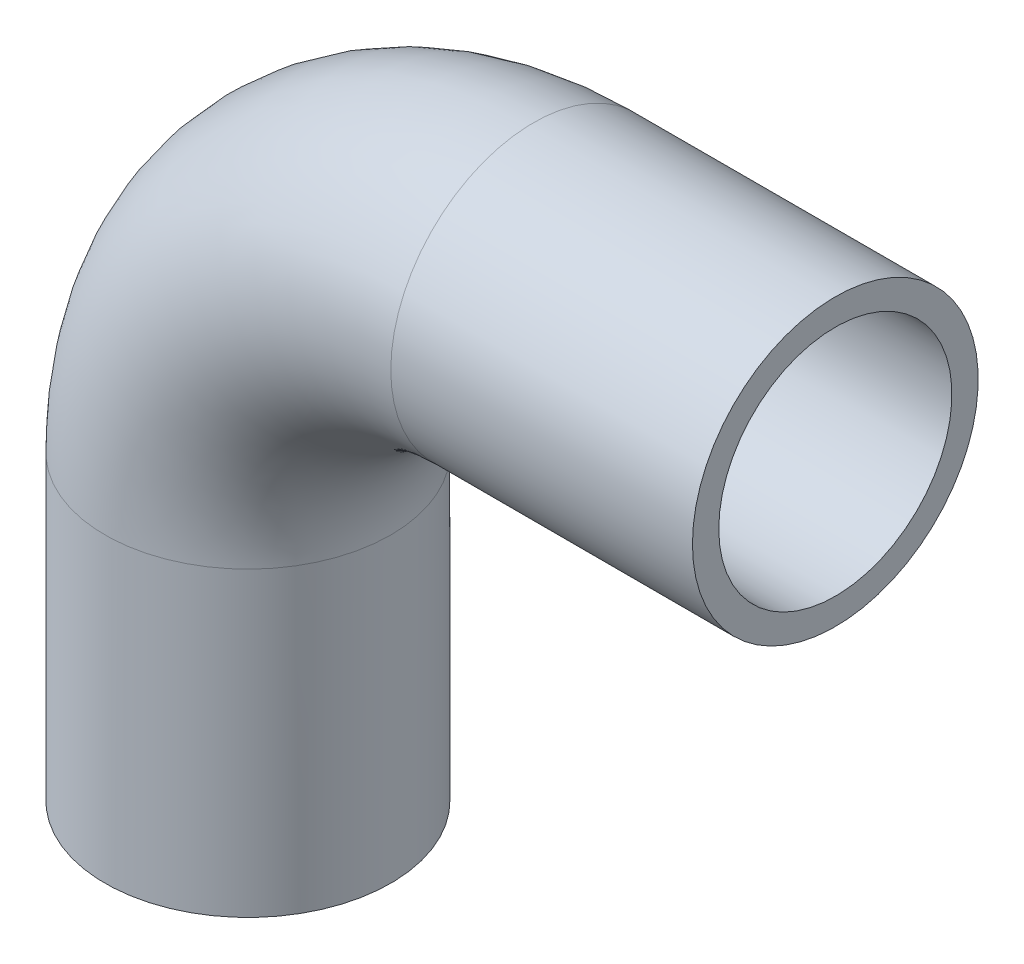
ISO-10303-21;
HEADER;
FILE_DESCRIPTION(('STEP AP214'),'2;1');
FILE_NAME('part.step','',(''),(''),'','','');
FILE_SCHEMA(('AUTOMOTIVE_DESIGN { 1 0 10303 214 1 1 1 1 }'));
ENDSEC;
DATA;
#1=APPLICATION_CONTEXT('core data for automotive mechanical design processes');
#2=APPLICATION_PROTOCOL_DEFINITION('international standard','automotive_design',2000,#1);
#3=PRODUCT_CONTEXT('',#1,'mechanical');
#4=PRODUCT('Part','Part','',(#3));
#5=PRODUCT_RELATED_PRODUCT_CATEGORY('part','',(#4));
#6=PRODUCT_DEFINITION_FORMATION('','',#4);
#7=PRODUCT_DEFINITION_CONTEXT('part definition',#1,'design');
#8=PRODUCT_DEFINITION('design','',#6,#7);
#9=PRODUCT_DEFINITION_SHAPE('','',#8);
#10=(LENGTH_UNIT() NAMED_UNIT(*) SI_UNIT(.MILLI.,.METRE.));
#11=(NAMED_UNIT(*) PLANE_ANGLE_UNIT() SI_UNIT($,.RADIAN.));
#12=(NAMED_UNIT(*) SI_UNIT($,.STERADIAN.) SOLID_ANGLE_UNIT());
#13=UNCERTAINTY_MEASURE_WITH_UNIT(LENGTH_MEASURE(1.E-05),#10,'distance_accuracy_value','');
#14=(GEOMETRIC_REPRESENTATION_CONTEXT(3) GLOBAL_UNCERTAINTY_ASSIGNED_CONTEXT((#13)) GLOBAL_UNIT_ASSIGNED_CONTEXT((#10,
#11,#12)) REPRESENTATION_CONTEXT('',''));
#15=CARTESIAN_POINT('',(0.,0.,0.));
#16=DIRECTION('',(0.,0.,1.));
#17=DIRECTION('',(1.,0.,0.));
#18=AXIS2_PLACEMENT_3D('',#15,#16,#17);
#19=CARTESIAN_POINT('',(63.,66.5,0.));
#20=DIRECTION('',(0.,0.,1.));
#21=DIRECTION('',(1.,0.,0.));
#22=AXIS2_PLACEMENT_3D('',#19,#20,#21);
#23=TOROIDAL_SURFACE('',#22,63.,25.7);
#24=CARTESIAN_POINT('',(63.,129.5,0.));
#25=DIRECTION('',(-1.,0.,0.));
#26=DIRECTION('',(0.,1.,0.));
#27=AXIS2_PLACEMENT_3D('',#24,#25,#26);
#28=CIRCLE('',#27,25.7);
#29=CARTESIAN_POINT('',(63.,155.2,0.));
#30=VERTEX_POINT('',#29);
#31=EDGE_CURVE('E33',#30,#30,#28,.T.);
#32=ORIENTED_EDGE('',*,*,#31,.F.);
#33=EDGE_LOOP('',(#32));
#34=FACE_BOUND('',#33,.T.);
#35=CARTESIAN_POINT('',(0.,66.5,0.));
#36=DIRECTION('',(0.,-1.,0.));
#37=DIRECTION('',(-1.,0.,0.));
#38=AXIS2_PLACEMENT_3D('',#35,#36,#37);
#39=CIRCLE('',#38,25.7);
#40=CARTESIAN_POINT('',(-25.7,66.5,0.));
#41=VERTEX_POINT('',#40);
#42=EDGE_CURVE('E31',#41,#41,#39,.F.);
#43=ORIENTED_EDGE('',*,*,#42,.F.);
#44=EDGE_LOOP('',(#43));
#45=FACE_BOUND('',#44,.T.);
#46=ADVANCED_FACE('F13',(#34,#45),#23,.F.);
#47=CARTESIAN_POINT('',(129.5,129.5,0.));
#48=DIRECTION('',(-1.,0.,0.));
#49=DIRECTION('',(0.,0.,1.));
#50=AXIS2_PLACEMENT_3D('',#47,#48,#49);
#51=CYLINDRICAL_SURFACE('',#50,25.7);
#52=CARTESIAN_POINT('',(129.5,129.5,0.));
#53=DIRECTION('',(-1.,0.,0.));
#54=DIRECTION('',(0.,0.,1.));
#55=AXIS2_PLACEMENT_3D('',#52,#53,#54);
#56=CIRCLE('',#55,25.7);
#57=CARTESIAN_POINT('',(129.5,129.5,25.7));
#58=VERTEX_POINT('',#57);
#59=EDGE_CURVE('E17',#58,#58,#56,.T.);
#60=ORIENTED_EDGE('',*,*,#59,.F.);
#61=EDGE_LOOP('',(#60));
#62=FACE_BOUND('',#61,.T.);
#63=ORIENTED_EDGE('',*,*,#31,.T.);
#64=EDGE_LOOP('',(#63));
#65=FACE_BOUND('',#64,.T.);
#66=ADVANCED_FACE('F52',(#62,#65),#51,.F.);
#67=CARTESIAN_POINT('',(0.,66.5,0.));
#68=DIRECTION('',(0.,-1.,0.));
#69=DIRECTION('',(0.,0.,-1.));
#70=AXIS2_PLACEMENT_3D('',#67,#68,#69);
#71=CYLINDRICAL_SURFACE('',#70,25.7);
#72=ORIENTED_EDGE('',*,*,#42,.T.);
#73=EDGE_LOOP('',(#72));
#74=FACE_BOUND('',#73,.T.);
#75=CARTESIAN_POINT('',(0.,0.,0.));
#76=DIRECTION('',(0.,-1.,0.));
#77=DIRECTION('',(0.,0.,-1.));
#78=AXIS2_PLACEMENT_3D('',#75,#76,#77);
#79=CIRCLE('',#78,25.7);
#80=CARTESIAN_POINT('',(0.,0.,-25.7));
#81=VERTEX_POINT('',#80);
#82=EDGE_CURVE('E42',#81,#81,#79,.F.);
#83=ORIENTED_EDGE('',*,*,#82,.F.);
#84=EDGE_LOOP('',(#83));
#85=FACE_BOUND('',#84,.T.);
#86=ADVANCED_FACE('F55',(#74,#85),#71,.F.);
#87=CARTESIAN_POINT('',(129.5,161.,31.8780010540613));
#88=DIRECTION('',(1.,0.,0.));
#89=DIRECTION('',(0.,-1.,0.));
#90=AXIS2_PLACEMENT_3D('',#87,#88,#89);
#91=PLANE('',#90);
#92=ORIENTED_EDGE('',*,*,#59,.T.);
#93=EDGE_LOOP('',(#92));
#94=FACE_BOUND('',#93,.T.);
#95=CARTESIAN_POINT('',(129.5,129.5,0.));
#96=DIRECTION('',(-1.,0.,0.));
#97=DIRECTION('',(0.,0.,1.));
#98=AXIS2_PLACEMENT_3D('',#95,#96,#97);
#99=CIRCLE('',#98,31.5);
#100=CARTESIAN_POINT('',(129.5,129.5,31.5));
#101=VERTEX_POINT('',#100);
#102=EDGE_CURVE('E40',#101,#101,#99,.T.);
#103=ORIENTED_EDGE('',*,*,#102,.F.);
#104=EDGE_LOOP('',(#103));
#105=FACE_BOUND('',#104,.T.);
#106=ADVANCED_FACE('F49',(#94,#105),#91,.T.);
#107=CARTESIAN_POINT('',(31.5,0.,31.8780010540601));
#108=DIRECTION('',(0.,-1.,0.));
#109=DIRECTION('',(-1.,0.,0.));
#110=AXIS2_PLACEMENT_3D('',#107,#108,#109);
#111=PLANE('',#110);
#112=ORIENTED_EDGE('',*,*,#82,.T.);
#113=EDGE_LOOP('',(#112));
#114=FACE_BOUND('',#113,.T.);
#115=CARTESIAN_POINT('',(0.,0.,0.));
#116=DIRECTION('',(0.,-1.,0.));
#117=DIRECTION('',(0.,0.,-1.));
#118=AXIS2_PLACEMENT_3D('',#115,#116,#117);
#119=CIRCLE('',#118,31.5);
#120=CARTESIAN_POINT('',(0.,0.,-31.5));
#121=VERTEX_POINT('',#120);
#122=EDGE_CURVE('E26',#121,#121,#119,.F.);
#123=ORIENTED_EDGE('',*,*,#122,.F.);
#124=EDGE_LOOP('',(#123));
#125=FACE_BOUND('',#124,.T.);
#126=ADVANCED_FACE('F69',(#114,#125),#111,.T.);
#127=CARTESIAN_POINT('',(63.,129.5,0.));
#128=DIRECTION('',(-1.,0.,0.));
#129=DIRECTION('',(0.,0.,1.));
#130=AXIS2_PLACEMENT_3D('',#127,#128,#129);
#131=CYLINDRICAL_SURFACE('',#130,31.5);
#132=ORIENTED_EDGE('',*,*,#102,.T.);
#133=EDGE_LOOP('',(#132));
#134=FACE_BOUND('',#133,.T.);
#135=CARTESIAN_POINT('',(63.,129.5,0.));
#136=DIRECTION('',(-1.,0.,0.));
#137=DIRECTION('',(0.,-1.,0.));
#138=AXIS2_PLACEMENT_3D('',#135,#136,#137);
#139=CIRCLE('',#138,31.5);
#140=CARTESIAN_POINT('',(63.,98.,0.));
#141=VERTEX_POINT('',#140);
#142=EDGE_CURVE('E21',#141,#141,#139,.T.);
#143=ORIENTED_EDGE('',*,*,#142,.F.);
#144=EDGE_LOOP('',(#143));
#145=FACE_BOUND('',#144,.T.);
#146=ADVANCED_FACE('F79',(#134,#145),#131,.T.);
#147=CARTESIAN_POINT('',(0.,0.,0.));
#148=DIRECTION('',(0.,-1.,0.));
#149=DIRECTION('',(0.,0.,-1.));
#150=AXIS2_PLACEMENT_3D('',#147,#148,#149);
#151=CYLINDRICAL_SURFACE('',#150,31.5);
#152=CARTESIAN_POINT('',(0.,66.5,0.));
#153=DIRECTION('',(0.,-1.,0.));
#154=DIRECTION('',(1.,0.,0.));
#155=AXIS2_PLACEMENT_3D('',#152,#153,#154);
#156=CIRCLE('',#155,31.5);
#157=CARTESIAN_POINT('',(31.5,66.5,0.));
#158=VERTEX_POINT('',#157);
#159=EDGE_CURVE('E8',#158,#158,#156,.F.);
#160=ORIENTED_EDGE('',*,*,#159,.F.);
#161=EDGE_LOOP('',(#160));
#162=FACE_BOUND('',#161,.T.);
#163=ORIENTED_EDGE('',*,*,#122,.T.);
#164=EDGE_LOOP('',(#163));
#165=FACE_BOUND('',#164,.T.);
#166=ADVANCED_FACE('F73',(#162,#165),#151,.T.);
#167=CARTESIAN_POINT('',(63.,66.5,0.));
#168=DIRECTION('',(0.,0.,1.));
#169=DIRECTION('',(1.,0.,0.));
#170=AXIS2_PLACEMENT_3D('',#167,#168,#169);
#171=TOROIDAL_SURFACE('',#170,63.,31.5);
#172=ORIENTED_EDGE('',*,*,#142,.T.);
#173=EDGE_LOOP('',(#172));
#174=FACE_BOUND('',#173,.T.);
#175=ORIENTED_EDGE('',*,*,#159,.T.);
#176=EDGE_LOOP('',(#175));
#177=FACE_BOUND('',#176,.T.);
#178=ADVANCED_FACE('F71',(#174,#177),#171,.T.);
#179=CLOSED_SHELL('',(#46,#66,#86,#106,#126,#146,#166,#178));
#180=MANIFOLD_SOLID_BREP('B1',#179);
#181=ADVANCED_BREP_SHAPE_REPRESENTATION('',(#18,#180),#14);
#182=SHAPE_DEFINITION_REPRESENTATION(#9,#181);
ENDSEC;
END-ISO-10303-21;
